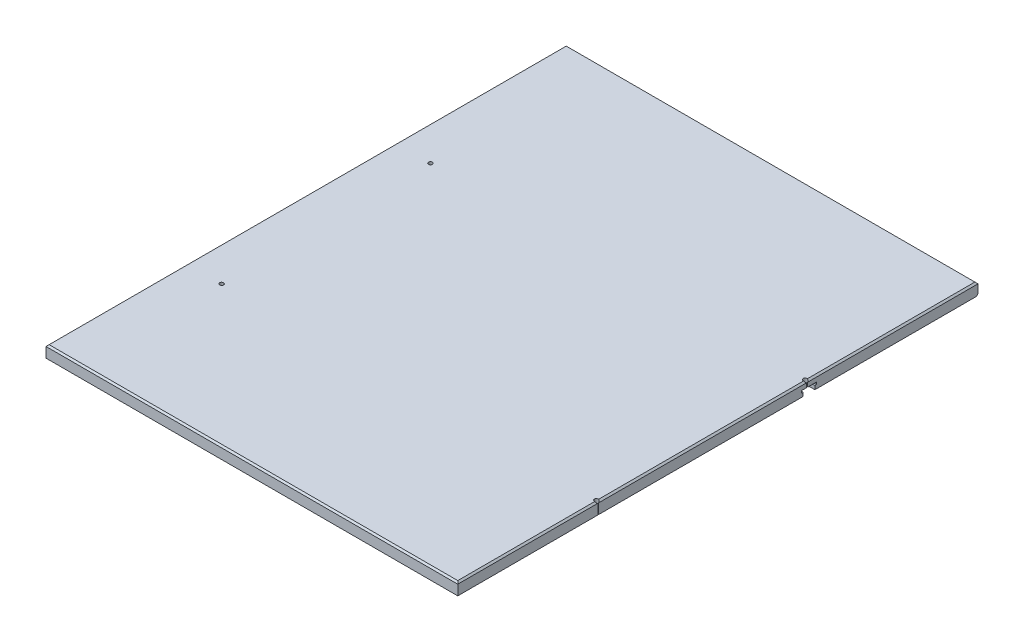
ISO-10303-21;
HEADER;
FILE_DESCRIPTION(('STEP AP214'),'2;1');
FILE_NAME('part.step','',(''),(''),'','','');
FILE_SCHEMA(('AUTOMOTIVE_DESIGN { 1 0 10303 214 1 1 1 1 }'));
ENDSEC;
DATA;
#1=APPLICATION_CONTEXT('core data for automotive mechanical design processes');
#2=APPLICATION_PROTOCOL_DEFINITION('international standard','automotive_design',2000,#1);
#3=PRODUCT_CONTEXT('',#1,'mechanical');
#4=PRODUCT('Part','Part','',(#3));
#5=PRODUCT_RELATED_PRODUCT_CATEGORY('part','',(#4));
#6=PRODUCT_DEFINITION_FORMATION('','',#4);
#7=PRODUCT_DEFINITION_CONTEXT('part definition',#1,'design');
#8=PRODUCT_DEFINITION('design','',#6,#7);
#9=PRODUCT_DEFINITION_SHAPE('','',#8);
#10=(LENGTH_UNIT() NAMED_UNIT(*) SI_UNIT(.MILLI.,.METRE.));
#11=(NAMED_UNIT(*) PLANE_ANGLE_UNIT() SI_UNIT($,.RADIAN.));
#12=(NAMED_UNIT(*) SI_UNIT($,.STERADIAN.) SOLID_ANGLE_UNIT());
#13=UNCERTAINTY_MEASURE_WITH_UNIT(LENGTH_MEASURE(1.E-05),#10,'distance_accuracy_value','');
#14=(GEOMETRIC_REPRESENTATION_CONTEXT(3) GLOBAL_UNCERTAINTY_ASSIGNED_CONTEXT((#13)) GLOBAL_UNIT_ASSIGNED_CONTEXT((#10,
#11,#12)) REPRESENTATION_CONTEXT('',''));
#15=CARTESIAN_POINT('',(0.,0.,0.));
#16=DIRECTION('',(0.,0.,1.));
#17=DIRECTION('',(1.,0.,0.));
#18=AXIS2_PLACEMENT_3D('',#15,#16,#17);
#19=CARTESIAN_POINT('',(669.8488,19.05,0.));
#20=DIRECTION('',(-1.,0.,0.));
#21=DIRECTION('',(0.,0.,1.));
#22=AXIS2_PLACEMENT_3D('',#19,#20,#21);
#23=PLANE('',#22);
#24=DIRECTION('',(0.,0.,1.));
#25=VECTOR('',#24,1.);
#26=CARTESIAN_POINT('',(669.8488,9.53134999998069,0.));
#27=LINE('',#26,#25);
#28=CARTESIAN_POINT('',(669.8488,9.53134999998069,-567.633578594489));
#29=VERTEX_POINT('',#28);
#30=CARTESIAN_POINT('',(669.8488,9.53134999998069,-559.216560000048));
#31=VERTEX_POINT('',#30);
#32=EDGE_CURVE('E353',#29,#31,#27,.T.);
#33=ORIENTED_EDGE('',*,*,#32,.F.);
#34=DIRECTION('',(0.,1.,0.));
#35=VECTOR('',#34,1.);
#36=CARTESIAN_POINT('',(669.8488,0.,-567.633578594489));
#37=LINE('',#36,#35);
#38=CARTESIAN_POINT('',(669.8488,16.5100000000001,-567.633578594489));
#39=VERTEX_POINT('',#38);
#40=EDGE_CURVE('E66',#29,#39,#37,.T.);
#41=ORIENTED_EDGE('',*,*,#40,.T.);
#42=DIRECTION('',(0.,0.,1.));
#43=VECTOR('',#42,1.);
#44=CARTESIAN_POINT('',(669.8488,16.5100000000001,0.));
#45=LINE('',#44,#43);
#46=CARTESIAN_POINT('',(669.8488,16.5100000000001,-229.291421405512));
#47=VERTEX_POINT('',#46);
#48=EDGE_CURVE('E201',#39,#47,#45,.T.);
#49=ORIENTED_EDGE('',*,*,#48,.T.);
#50=DIRECTION('',(0.,1.,0.));
#51=VECTOR('',#50,1.);
#52=CARTESIAN_POINT('',(669.8488,0.,-229.291421405512));
#53=LINE('',#52,#51);
#54=CARTESIAN_POINT('',(669.8488,0.,-229.291421405512));
#55=VERTEX_POINT('',#54);
#56=EDGE_CURVE('E58',#47,#55,#53,.F.);
#57=ORIENTED_EDGE('',*,*,#56,.T.);
#58=DIRECTION('',(0.,0.,-1.));
#59=VECTOR('',#58,1.);
#60=CARTESIAN_POINT('',(669.8488,0.,0.));
#61=LINE('',#60,#59);
#62=CARTESIAN_POINT('',(669.8488,0.,-561.883560000048));
#63=VERTEX_POINT('',#62);
#64=EDGE_CURVE('E300',#55,#63,#61,.T.);
#65=ORIENTED_EDGE('',*,*,#64,.T.);
#66=DIRECTION('',(0.,-1.,0.));
#67=VECTOR('',#66,1.);
#68=CARTESIAN_POINT('',(669.8488,0.,-561.883560000048));
#69=LINE('',#68,#67);
#70=CARTESIAN_POINT('',(669.8488,5.97534999998069,-561.883560000048));
#71=VERTEX_POINT('',#70);
#72=EDGE_CURVE('E326',#71,#63,#69,.T.);
#73=ORIENTED_EDGE('',*,*,#72,.F.);
#74=DIRECTION('',(0.,0.,-1.));
#75=VECTOR('',#74,1.);
#76=CARTESIAN_POINT('',(669.8488,5.97534999998069,0.));
#77=LINE('',#76,#75);
#78=CARTESIAN_POINT('',(669.8488,5.97534999998069,-559.216560000048));
#79=VERTEX_POINT('',#78);
#80=EDGE_CURVE('E356',#79,#71,#77,.T.);
#81=ORIENTED_EDGE('',*,*,#80,.F.);
#82=DIRECTION('',(0.,-1.,0.));
#83=VECTOR('',#82,1.);
#84=CARTESIAN_POINT('',(669.8488,0.,-559.216560000048));
#85=LINE('',#84,#83);
#86=EDGE_CURVE('E354',#31,#79,#85,.T.);
#87=ORIENTED_EDGE('',*,*,#86,.F.);
#88=EDGE_LOOP('',(#33,#41,#49,#57,#65,#73,#81,#87));
#89=FACE_BOUND('',#88,.T.);
#90=ADVANCED_FACE('F42',(#89),#23,.F.);
#91=CARTESIAN_POINT('',(669.8488,0.,0.));
#92=VERTEX_POINT('',#91);
#93=CARTESIAN_POINT('',(669.8488,0.,-227.908578594488));
#94=VERTEX_POINT('',#93);
#95=EDGE_CURVE('E298',#92,#94,#61,.T.);
#96=ORIENTED_EDGE('',*,*,#95,.T.);
#97=DIRECTION('',(0.,1.,0.));
#98=VECTOR('',#97,1.);
#99=CARTESIAN_POINT('',(669.8488,0.,-227.908578594488));
#100=LINE('',#99,#98);
#101=CARTESIAN_POINT('',(669.8488,16.5100000000001,-227.908578594488));
#102=VERTEX_POINT('',#101);
#103=EDGE_CURVE('E268',#94,#102,#100,.T.);
#104=ORIENTED_EDGE('',*,*,#103,.T.);
#105=CARTESIAN_POINT('',(669.8488,16.5100000000001,0.));
#106=VERTEX_POINT('',#105);
#107=EDGE_CURVE('E219',#102,#106,#45,.T.);
#108=ORIENTED_EDGE('',*,*,#107,.T.);
#109=DIRECTION('',(0.,-1.,0.));
#110=VECTOR('',#109,1.);
#111=CARTESIAN_POINT('',(669.8488,19.05,0.));
#112=LINE('',#111,#110);
#113=EDGE_CURVE('E266',#106,#92,#112,.T.);
#114=ORIENTED_EDGE('',*,*,#113,.T.);
#115=EDGE_LOOP('',(#96,#104,#108,#114));
#116=FACE_BOUND('',#115,.T.);
#117=ADVANCED_FACE('F265',(#116),#23,.F.);
#118=CARTESIAN_POINT('',(667.3088,19.05,0.));
#119=DIRECTION('',(-0.707106781186532,-0.707106781186563,0.));
#120=DIRECTION('',(0.,0.,-1.));
#121=AXIS2_PLACEMENT_3D('',#118,#119,#120);
#122=PLANE('',#121);
#123=CARTESIAN_POINT('',(666.75,19.6088000000002,-568.325));
#124=DIRECTION('',(-0.707106781186532,-0.707106781186563,0.));
#125=DIRECTION('',(-0.707106781186563,0.707106781186532,0.));
#126=AXIS2_PLACEMENT_3D('',#123,#124,#125);
#127=ELLIPSE('',#126,4.49012806053459,3.17500000000008);
#128=CARTESIAN_POINT('',(667.3088,19.05,-565.199561221204));
#129=VERTEX_POINT('',#128);
#130=EDGE_CURVE('E186',#129,#39,#127,.F.);
#131=ORIENTED_EDGE('',*,*,#130,.F.);
#132=DIRECTION('',(0.,0.,-1.));
#133=VECTOR('',#132,1.);
#134=CARTESIAN_POINT('',(667.3088,19.05,0.));
#135=LINE('',#134,#133);
#136=CARTESIAN_POINT('',(667.3088,19.05,-231.725438778796));
#137=VERTEX_POINT('',#136);
#138=EDGE_CURVE('E199',#137,#129,#135,.T.);
#139=ORIENTED_EDGE('',*,*,#138,.F.);
#140=CARTESIAN_POINT('',(666.75,19.6088000000001,-228.6));
#141=DIRECTION('',(-0.707106781186532,-0.707106781186563,0.));
#142=DIRECTION('',(-0.707106781186563,0.707106781186532,0.));
#143=AXIS2_PLACEMENT_3D('',#140,#141,#142);
#144=ELLIPSE('',#143,4.4901280605346,3.17500000000009);
#145=EDGE_CURVE('E47',#47,#137,#144,.F.);
#146=ORIENTED_EDGE('',*,*,#145,.F.);
#147=ORIENTED_EDGE('',*,*,#48,.F.);
#148=EDGE_LOOP('',(#131,#139,#146,#147));
#149=FACE_BOUND('',#148,.T.);
#150=ADVANCED_FACE('F198',(#149),#122,.F.);
#151=CARTESIAN_POINT('',(667.3088,19.05,-225.474561221204));
#152=VERTEX_POINT('',#151);
#153=EDGE_CURVE('E11',#152,#102,#144,.F.);
#154=ORIENTED_EDGE('',*,*,#153,.F.);
#155=CARTESIAN_POINT('',(667.3088,19.05,-2.53999999999999));
#156=VERTEX_POINT('',#155);
#157=EDGE_CURVE('E206',#156,#152,#135,.T.);
#158=ORIENTED_EDGE('',*,*,#157,.F.);
#159=DIRECTION('',(-0.577350269189634,0.577350269189609,-0.577350269189634));
#160=VECTOR('',#159,1.);
#161=CARTESIAN_POINT('',(444.872533333327,241.486266666664,-224.976266666673));
#162=LINE('',#161,#160);
#163=EDGE_CURVE('E236',#156,#106,#162,.F.);
#164=ORIENTED_EDGE('',*,*,#163,.T.);
#165=ORIENTED_EDGE('',*,*,#107,.F.);
#166=EDGE_LOOP('',(#154,#158,#164,#165));
#167=FACE_BOUND('',#166,.T.);
#168=ADVANCED_FACE('F288',(#167),#122,.F.);
#169=CARTESIAN_POINT('',(0.,19.05,0.));
#170=DIRECTION('',(1.,0.,0.));
#171=DIRECTION('',(0.,0.,-1.));
#172=AXIS2_PLACEMENT_3D('',#169,#170,#171);
#173=PLANE('',#172);
#174=DIRECTION('',(0.,1.,0.));
#175=VECTOR('',#174,1.);
#176=CARTESIAN_POINT('',(0.,0.,-580.933560000048));
#177=LINE('',#176,#175);
#178=CARTESIAN_POINT('',(0.,0.,-580.933560000048));
#179=VERTEX_POINT('',#178);
#180=CARTESIAN_POINT('',(0.,5.9753499999807,-580.933560000048));
#181=VERTEX_POINT('',#180);
#182=EDGE_CURVE('E323',#179,#181,#177,.T.);
#183=ORIENTED_EDGE('',*,*,#182,.T.);
#184=DIRECTION('',(0.,0.,-1.));
#185=VECTOR('',#184,1.);
#186=CARTESIAN_POINT('',(0.,5.9753499999807,0.));
#187=LINE('',#186,#185);
#188=CARTESIAN_POINT('',(0.,5.9753499999807,-583.600560000048));
#189=VERTEX_POINT('',#188);
#190=EDGE_CURVE('E327',#181,#189,#187,.T.);
#191=ORIENTED_EDGE('',*,*,#190,.T.);
#192=DIRECTION('',(0.,1.,0.));
#193=VECTOR('',#192,1.);
#194=CARTESIAN_POINT('',(0.,0.,-583.600560000048));
#195=LINE('',#194,#193);
#196=CARTESIAN_POINT('',(0.,9.53134999998069,-583.600560000048));
#197=VERTEX_POINT('',#196);
#198=EDGE_CURVE('E330',#189,#197,#195,.T.);
#199=ORIENTED_EDGE('',*,*,#198,.T.);
#200=DIRECTION('',(0.,0.,1.));
#201=VECTOR('',#200,1.);
#202=CARTESIAN_POINT('',(0.,9.53134999998069,0.));
#203=LINE('',#202,#201);
#204=CARTESIAN_POINT('',(0.,9.53134999998069,-559.216560000048));
#205=VERTEX_POINT('',#204);
#206=EDGE_CURVE('E333',#197,#205,#203,.T.);
#207=ORIENTED_EDGE('',*,*,#206,.T.);
#208=DIRECTION('',(0.,-1.,0.));
#209=VECTOR('',#208,1.);
#210=CARTESIAN_POINT('',(0.,0.,-559.216560000048));
#211=LINE('',#210,#209);
#212=CARTESIAN_POINT('',(0.,5.97534999998069,-559.216560000048));
#213=VERTEX_POINT('',#212);
#214=EDGE_CURVE('E336',#205,#213,#211,.T.);
#215=ORIENTED_EDGE('',*,*,#214,.T.);
#216=DIRECTION('',(0.,0.,-1.));
#217=VECTOR('',#216,1.);
#218=CARTESIAN_POINT('',(0.,5.97534999998069,0.));
#219=LINE('',#218,#217);
#220=CARTESIAN_POINT('',(0.,5.97534999998069,-561.883560000048));
#221=VERTEX_POINT('',#220);
#222=EDGE_CURVE('E339',#213,#221,#219,.T.);
#223=ORIENTED_EDGE('',*,*,#222,.T.);
#224=DIRECTION('',(0.,-1.,0.));
#225=VECTOR('',#224,1.);
#226=CARTESIAN_POINT('',(0.,0.,-561.883560000048));
#227=LINE('',#226,#225);
#228=CARTESIAN_POINT('',(0.,0.,-561.883560000048));
#229=VERTEX_POINT('',#228);
#230=EDGE_CURVE('E342',#221,#229,#227,.T.);
#231=ORIENTED_EDGE('',*,*,#230,.T.);
#232=DIRECTION('',(0.,0.,1.));
#233=VECTOR('',#232,1.);
#234=CARTESIAN_POINT('',(0.,0.,0.));
#235=LINE('',#234,#233);
#236=CARTESIAN_POINT('',(0.,0.,0.));
#237=VERTEX_POINT('',#236);
#238=EDGE_CURVE('E239',#229,#237,#235,.T.);
#239=ORIENTED_EDGE('',*,*,#238,.T.);
#240=DIRECTION('',(0.,-1.,0.));
#241=VECTOR('',#240,1.);
#242=CARTESIAN_POINT('',(0.,19.05,0.));
#243=LINE('',#242,#241);
#244=CARTESIAN_POINT('',(0.,16.5100000000001,0.));
#245=VERTEX_POINT('',#244);
#246=EDGE_CURVE('E278',#245,#237,#243,.T.);
#247=ORIENTED_EDGE('',*,*,#246,.F.);
#248=DIRECTION('',(0.,0.,-1.));
#249=VECTOR('',#248,1.);
#250=CARTESIAN_POINT('',(0.,16.5100000000001,0.));
#251=LINE('',#250,#249);
#252=CARTESIAN_POINT('',(0.,16.5100000000001,-846.328));
#253=VERTEX_POINT('',#252);
#254=EDGE_CURVE('E225',#245,#253,#251,.T.);
#255=ORIENTED_EDGE('',*,*,#254,.T.);
#256=DIRECTION('',(0.,-1.,0.));
#257=VECTOR('',#256,1.);
#258=CARTESIAN_POINT('',(0.,19.05,-846.328));
#259=LINE('',#258,#257);
#260=CARTESIAN_POINT('',(0.,2.5400000000001,-846.328));
#261=VERTEX_POINT('',#260);
#262=EDGE_CURVE('E295',#253,#261,#259,.T.);
#263=ORIENTED_EDGE('',*,*,#262,.T.);
#264=DIRECTION('',(0.,-0.707106781186548,0.707106781186548));
#265=VECTOR('',#264,1.);
#266=CARTESIAN_POINT('',(0.,2.5400000000001,-846.328));
#267=LINE('',#266,#265);
#268=CARTESIAN_POINT('',(0.,0.,-843.788));
#269=VERTEX_POINT('',#268);
#270=EDGE_CURVE('E242',#261,#269,#267,.T.);
#271=ORIENTED_EDGE('',*,*,#270,.T.);
#272=EDGE_CURVE('E303',#269,#179,#235,.T.);
#273=ORIENTED_EDGE('',*,*,#272,.T.);
#274=EDGE_LOOP('',(#183,#191,#199,#207,#215,#223,#231,#239,#247,#255,#263,#271,#273));
#275=FACE_BOUND('',#274,.T.);
#276=ADVANCED_FACE('F397',(#275),#173,.F.);
#277=CARTESIAN_POINT('',(669.8488,16.5100000000001,-846.328));
#278=VERTEX_POINT('',#277);
#279=CARTESIAN_POINT('',(669.8488,16.5100000000001,-569.016421405511));
#280=VERTEX_POINT('',#279);
#281=EDGE_CURVE('E220',#278,#280,#45,.T.);
#282=ORIENTED_EDGE('',*,*,#281,.T.);
#283=DIRECTION('',(0.,1.,0.));
#284=VECTOR('',#283,1.);
#285=CARTESIAN_POINT('',(669.8488,0.,-569.016421405511));
#286=LINE('',#285,#284);
#287=CARTESIAN_POINT('',(669.8488,9.53134999998069,-569.016421405511));
#288=VERTEX_POINT('',#287);
#289=EDGE_CURVE('E252',#280,#288,#286,.F.);
#290=ORIENTED_EDGE('',*,*,#289,.T.);
#291=CARTESIAN_POINT('',(669.8488,9.53134999998069,-583.600560000048));
#292=VERTEX_POINT('',#291);
#293=EDGE_CURVE('E350',#292,#288,#27,.T.);
#294=ORIENTED_EDGE('',*,*,#293,.F.);
#295=DIRECTION('',(0.,1.,0.));
#296=VECTOR('',#295,1.);
#297=CARTESIAN_POINT('',(669.8488,0.,-583.600560000048));
#298=LINE('',#297,#296);
#299=CARTESIAN_POINT('',(669.8488,5.9753499999807,-583.600560000048));
#300=VERTEX_POINT('',#299);
#301=EDGE_CURVE('E348',#300,#292,#298,.T.);
#302=ORIENTED_EDGE('',*,*,#301,.F.);
#303=DIRECTION('',(0.,0.,-1.));
#304=VECTOR('',#303,1.);
#305=CARTESIAN_POINT('',(669.8488,5.9753499999807,0.));
#306=LINE('',#305,#304);
#307=CARTESIAN_POINT('',(669.8488,5.9753499999807,-580.933560000048));
#308=VERTEX_POINT('',#307);
#309=EDGE_CURVE('E346',#308,#300,#306,.T.);
#310=ORIENTED_EDGE('',*,*,#309,.F.);
#311=DIRECTION('',(0.,1.,0.));
#312=VECTOR('',#311,1.);
#313=CARTESIAN_POINT('',(669.8488,0.,-580.933560000048));
#314=LINE('',#313,#312);
#315=CARTESIAN_POINT('',(669.8488,0.,-580.933560000048));
#316=VERTEX_POINT('',#315);
#317=EDGE_CURVE('E309',#316,#308,#314,.T.);
#318=ORIENTED_EDGE('',*,*,#317,.F.);
#319=CARTESIAN_POINT('',(669.8488,0.,-843.788));
#320=VERTEX_POINT('',#319);
#321=EDGE_CURVE('E301',#316,#320,#61,.T.);
#322=ORIENTED_EDGE('',*,*,#321,.T.);
#323=DIRECTION('',(0.,0.707106781186548,-0.707106781186548));
#324=VECTOR('',#323,1.);
#325=CARTESIAN_POINT('',(669.8488,2.5400000000001,-846.328));
#326=LINE('',#325,#324);
#327=CARTESIAN_POINT('',(669.8488,2.5400000000001,-846.328));
#328=VERTEX_POINT('',#327);
#329=EDGE_CURVE('E247',#320,#328,#326,.T.);
#330=ORIENTED_EDGE('',*,*,#329,.T.);
#331=DIRECTION('',(0.,-1.,0.));
#332=VECTOR('',#331,1.);
#333=CARTESIAN_POINT('',(669.8488,19.05,-846.328));
#334=LINE('',#333,#332);
#335=EDGE_CURVE('E279',#278,#328,#334,.T.);
#336=ORIENTED_EDGE('',*,*,#335,.F.);
#337=EDGE_LOOP('',(#282,#290,#294,#302,#310,#318,#322,#330,#336));
#338=FACE_BOUND('',#337,.T.);
#339=ADVANCED_FACE('F382',(#338),#23,.F.);
#340=CARTESIAN_POINT('',(0.,0.,0.));
#341=DIRECTION('',(0.,-1.,0.));
#342=DIRECTION('',(0.,0.,-1.));
#343=AXIS2_PLACEMENT_3D('',#340,#341,#342);
#344=PLANE('',#343);
#345=ORIENTED_EDGE('',*,*,#321,.F.);
#346=DIRECTION('',(-1.,0.,0.));
#347=VECTOR('',#346,1.);
#348=CARTESIAN_POINT('',(669.8488,0.,-580.933560000048));
#349=LINE('',#348,#347);
#350=EDGE_CURVE('E231',#316,#179,#349,.T.);
#351=ORIENTED_EDGE('',*,*,#350,.T.);
#352=ORIENTED_EDGE('',*,*,#272,.F.);
#353=DIRECTION('',(1.,0.,0.));
#354=VECTOR('',#353,1.);
#355=CARTESIAN_POINT('',(669.8488,0.,-843.788));
#356=LINE('',#355,#354);
#357=EDGE_CURVE('E244',#269,#320,#356,.T.);
#358=ORIENTED_EDGE('',*,*,#357,.T.);
#359=EDGE_LOOP('',(#345,#351,#352,#358));
#360=FACE_BOUND('',#359,.T.);
#361=ADVANCED_FACE('F389',(#360),#344,.T.);
#362=CARTESIAN_POINT('',(57.15,0.,-228.6));
#363=DIRECTION('',(0.,1.,0.));
#364=DIRECTION('',(0.,0.,1.));
#365=AXIS2_PLACEMENT_3D('',#362,#363,#364);
#366=CIRCLE('',#365,3.175);
#367=CARTESIAN_POINT('',(57.15,0.,-225.425));
#368=VERTEX_POINT('',#367);
#369=EDGE_CURVE('E192',#368,#368,#366,.T.);
#370=ORIENTED_EDGE('',*,*,#369,.T.);
#371=EDGE_LOOP('',(#370));
#372=FACE_BOUND('',#371,.T.);
#373=CARTESIAN_POINT('',(666.75,0.,-228.6));
#374=DIRECTION('',(0.,1.,0.));
#375=DIRECTION('',(0.,0.,1.));
#376=AXIS2_PLACEMENT_3D('',#373,#374,#375);
#377=CIRCLE('',#376,3.17500000000009);
#378=EDGE_CURVE('E371',#55,#94,#377,.T.);
#379=ORIENTED_EDGE('',*,*,#378,.T.);
#380=ORIENTED_EDGE('',*,*,#95,.F.);
#381=DIRECTION('',(1.,0.,0.));
#382=VECTOR('',#381,1.);
#383=CARTESIAN_POINT('',(0.,0.,0.));
#384=LINE('',#383,#382);
#385=EDGE_CURVE('E276',#237,#92,#384,.T.);
#386=ORIENTED_EDGE('',*,*,#385,.F.);
#387=ORIENTED_EDGE('',*,*,#238,.F.);
#388=DIRECTION('',(-1.,0.,0.));
#389=VECTOR('',#388,1.);
#390=CARTESIAN_POINT('',(669.8488,0.,-561.883560000048));
#391=LINE('',#390,#389);
#392=EDGE_CURVE('E306',#63,#229,#391,.T.);
#393=ORIENTED_EDGE('',*,*,#392,.F.);
#394=ORIENTED_EDGE('',*,*,#64,.F.);
#395=EDGE_LOOP('',(#379,#380,#386,#387,#393,#394));
#396=FACE_BOUND('',#395,.T.);
#397=ADVANCED_FACE('F375',(#372,#396),#344,.T.);
#398=CARTESIAN_POINT('',(0.,19.05,0.));
#399=DIRECTION('',(0.,0.,-1.));
#400=DIRECTION('',(-1.,0.,0.));
#401=AXIS2_PLACEMENT_3D('',#398,#399,#400);
#402=PLANE('',#401);
#403=ORIENTED_EDGE('',*,*,#113,.F.);
#404=DIRECTION('',(-1.,0.,0.));
#405=VECTOR('',#404,1.);
#406=CARTESIAN_POINT('',(0.,16.5100000000001,0.));
#407=LINE('',#406,#405);
#408=EDGE_CURVE('E223',#106,#245,#407,.T.);
#409=ORIENTED_EDGE('',*,*,#408,.T.);
#410=ORIENTED_EDGE('',*,*,#246,.T.);
#411=ORIENTED_EDGE('',*,*,#385,.T.);
#412=EDGE_LOOP('',(#403,#409,#410,#411));
#413=FACE_BOUND('',#412,.T.);
#414=ADVANCED_FACE('F272',(#413),#402,.F.);
#415=CARTESIAN_POINT('',(0.,19.05,-846.328));
#416=DIRECTION('',(0.,0.,1.));
#417=DIRECTION('',(1.,0.,0.));
#418=AXIS2_PLACEMENT_3D('',#415,#416,#417);
#419=PLANE('',#418);
#420=ORIENTED_EDGE('',*,*,#335,.T.);
#421=DIRECTION('',(-1.,0.,0.));
#422=VECTOR('',#421,1.);
#423=CARTESIAN_POINT('',(0.,2.5400000000001,-846.328));
#424=LINE('',#423,#422);
#425=EDGE_CURVE('E227',#328,#261,#424,.T.);
#426=ORIENTED_EDGE('',*,*,#425,.T.);
#427=ORIENTED_EDGE('',*,*,#262,.F.);
#428=DIRECTION('',(1.,0.,0.));
#429=VECTOR('',#428,1.);
#430=CARTESIAN_POINT('',(0.,16.5100000000001,-846.328));
#431=LINE('',#430,#429);
#432=EDGE_CURVE('E216',#253,#278,#431,.T.);
#433=ORIENTED_EDGE('',*,*,#432,.T.);
#434=EDGE_LOOP('',(#420,#426,#427,#433));
#435=FACE_BOUND('',#434,.T.);
#436=ADVANCED_FACE('F394',(#435),#419,.F.);
#437=CARTESIAN_POINT('',(0.,19.05,0.));
#438=DIRECTION('',(0.,-1.,0.));
#439=DIRECTION('',(0.,0.,-1.));
#440=AXIS2_PLACEMENT_3D('',#437,#438,#439);
#441=PLANE('',#440);
#442=CARTESIAN_POINT('',(57.15,19.05,-228.6));
#443=DIRECTION('',(0.,1.,0.));
#444=DIRECTION('',(0.,0.,1.));
#445=AXIS2_PLACEMENT_3D('',#442,#443,#444);
#446=CIRCLE('',#445,3.175);
#447=CARTESIAN_POINT('',(57.15,19.05,-225.425));
#448=VERTEX_POINT('',#447);
#449=EDGE_CURVE('E365',#448,#448,#446,.T.);
#450=ORIENTED_EDGE('',*,*,#449,.F.);
#451=EDGE_LOOP('',(#450));
#452=FACE_BOUND('',#451,.T.);
#453=CARTESIAN_POINT('',(57.1499999999999,19.05,-568.325));
#454=DIRECTION('',(0.,1.,0.));
#455=DIRECTION('',(0.,0.,1.));
#456=AXIS2_PLACEMENT_3D('',#453,#454,#455);
#457=CIRCLE('',#456,3.175);
#458=CARTESIAN_POINT('',(57.1499999999999,19.05,-565.15));
#459=VERTEX_POINT('',#458);
#460=EDGE_CURVE('E253',#459,#459,#457,.T.);
#461=ORIENTED_EDGE('',*,*,#460,.F.);
#462=EDGE_LOOP('',(#461));
#463=FACE_BOUND('',#462,.T.);
#464=ORIENTED_EDGE('',*,*,#138,.T.);
#465=CARTESIAN_POINT('',(666.75,19.05,-568.325));
#466=DIRECTION('',(0.,1.,0.));
#467=DIRECTION('',(0.,0.,1.));
#468=AXIS2_PLACEMENT_3D('',#465,#466,#467);
#469=CIRCLE('',#468,3.17500000000008);
#470=CARTESIAN_POINT('',(667.3088,19.05,-571.450438778796));
#471=VERTEX_POINT('',#470);
#472=EDGE_CURVE('E183',#471,#129,#469,.T.);
#473=ORIENTED_EDGE('',*,*,#472,.F.);
#474=CARTESIAN_POINT('',(667.3088,19.05,-843.788));
#475=VERTEX_POINT('',#474);
#476=EDGE_CURVE('E207',#471,#475,#135,.T.);
#477=ORIENTED_EDGE('',*,*,#476,.T.);
#478=DIRECTION('',(-1.,0.,0.));
#479=VECTOR('',#478,1.);
#480=CARTESIAN_POINT('',(0.,19.05,-843.788));
#481=LINE('',#480,#479);
#482=CARTESIAN_POINT('',(2.53999999999999,19.05,-843.788));
#483=VERTEX_POINT('',#482);
#484=EDGE_CURVE('E209',#475,#483,#481,.T.);
#485=ORIENTED_EDGE('',*,*,#484,.T.);
#486=DIRECTION('',(0.,0.,1.));
#487=VECTOR('',#486,1.);
#488=CARTESIAN_POINT('',(2.53999999999999,19.05,0.));
#489=LINE('',#488,#487);
#490=CARTESIAN_POINT('',(2.53999999999999,19.05,-2.53999999999999));
#491=VERTEX_POINT('',#490);
#492=EDGE_CURVE('E290',#483,#491,#489,.T.);
#493=ORIENTED_EDGE('',*,*,#492,.T.);
#494=DIRECTION('',(1.,0.,0.));
#495=VECTOR('',#494,1.);
#496=CARTESIAN_POINT('',(0.,19.05,-2.53999999999999));
#497=LINE('',#496,#495);
#498=EDGE_CURVE('E210',#491,#156,#497,.T.);
#499=ORIENTED_EDGE('',*,*,#498,.T.);
#500=ORIENTED_EDGE('',*,*,#157,.T.);
#501=CARTESIAN_POINT('',(666.75,19.05,-228.6));
#502=DIRECTION('',(0.,1.,0.));
#503=DIRECTION('',(0.,0.,1.));
#504=AXIS2_PLACEMENT_3D('',#501,#502,#503);
#505=CIRCLE('',#504,3.17500000000009);
#506=EDGE_CURVE('E193',#137,#152,#505,.T.);
#507=ORIENTED_EDGE('',*,*,#506,.F.);
#508=EDGE_LOOP('',(#464,#473,#477,#485,#493,#499,#500,#507));
#509=FACE_BOUND('',#508,.T.);
#510=ADVANCED_FACE('F204',(#452,#463,#509),#441,.F.);
#511=CARTESIAN_POINT('',(0.,19.05,-2.53999999999999));
#512=DIRECTION('',(0.,-0.707106781186563,-0.707106781186532));
#513=DIRECTION('',(1.,0.,0.));
#514=AXIS2_PLACEMENT_3D('',#511,#512,#513);
#515=PLANE('',#514);
#516=DIRECTION('',(0.577350269189634,0.577350269189609,-0.577350269189634));
#517=VECTOR('',#516,1.);
#518=CARTESIAN_POINT('',(1.6933333333333,18.2033333333334,-1.6933333333333));
#519=LINE('',#518,#517);
#520=EDGE_CURVE('E233',#245,#491,#519,.T.);
#521=ORIENTED_EDGE('',*,*,#520,.F.);
#522=ORIENTED_EDGE('',*,*,#408,.F.);
#523=ORIENTED_EDGE('',*,*,#163,.F.);
#524=ORIENTED_EDGE('',*,*,#498,.F.);
#525=EDGE_LOOP('',(#521,#522,#523,#524));
#526=FACE_BOUND('',#525,.T.);
#527=ADVANCED_FACE('F284',(#526),#515,.F.);
#528=EDGE_CURVE('E188',#280,#471,#127,.F.);
#529=ORIENTED_EDGE('',*,*,#528,.F.);
#530=ORIENTED_EDGE('',*,*,#281,.F.);
#531=DIRECTION('',(-0.577350269189634,0.577350269189609,0.577350269189634));
#532=VECTOR('',#531,1.);
#533=CARTESIAN_POINT('',(386.046133333325,300.312666666663,-562.525333333325));
#534=LINE('',#533,#532);
#535=EDGE_CURVE('E230',#475,#278,#534,.F.);
#536=ORIENTED_EDGE('',*,*,#535,.F.);
#537=ORIENTED_EDGE('',*,*,#476,.F.);
#538=EDGE_LOOP('',(#529,#530,#536,#537));
#539=FACE_BOUND('',#538,.T.);
#540=ADVANCED_FACE('F408',(#539),#122,.F.);
#541=CARTESIAN_POINT('',(2.53999999999999,19.05,0.));
#542=DIRECTION('',(0.707106781186532,-0.707106781186563,0.));
#543=DIRECTION('',(0.,0.,1.));
#544=AXIS2_PLACEMENT_3D('',#541,#542,#543);
#545=PLANE('',#544);
#546=ORIENTED_EDGE('',*,*,#520,.T.);
#547=ORIENTED_EDGE('',*,*,#492,.F.);
#548=DIRECTION('',(-0.577350269189634,-0.577350269189609,-0.577350269189634));
#549=VECTOR('',#548,1.);
#550=CARTESIAN_POINT('',(283.802666666675,300.312666666663,-562.525333333325));
#551=LINE('',#550,#549);
#552=EDGE_CURVE('E228',#253,#483,#551,.F.);
#553=ORIENTED_EDGE('',*,*,#552,.F.);
#554=ORIENTED_EDGE('',*,*,#254,.F.);
#555=EDGE_LOOP('',(#546,#547,#553,#554));
#556=FACE_BOUND('',#555,.T.);
#557=ADVANCED_FACE('F400',(#556),#545,.F.);
#558=CARTESIAN_POINT('',(0.,19.05,-843.788));
#559=DIRECTION('',(0.,-0.707106781186563,0.707106781186532));
#560=DIRECTION('',(-1.,0.,0.));
#561=AXIS2_PLACEMENT_3D('',#558,#559,#560);
#562=PLANE('',#561);
#563=ORIENTED_EDGE('',*,*,#535,.T.);
#564=ORIENTED_EDGE('',*,*,#432,.F.);
#565=ORIENTED_EDGE('',*,*,#552,.T.);
#566=ORIENTED_EDGE('',*,*,#484,.F.);
#567=EDGE_LOOP('',(#563,#564,#565,#566));
#568=FACE_BOUND('',#567,.T.);
#569=ADVANCED_FACE('F403',(#568),#562,.F.);
#570=CARTESIAN_POINT('',(0.,2.5400000000001,-846.328));
#571=DIRECTION('',(0.,-0.707106781186548,-0.707106781186548));
#572=DIRECTION('',(1.,0.,0.));
#573=AXIS2_PLACEMENT_3D('',#570,#571,#572);
#574=PLANE('',#573);
#575=ORIENTED_EDGE('',*,*,#329,.F.);
#576=ORIENTED_EDGE('',*,*,#357,.F.);
#577=ORIENTED_EDGE('',*,*,#270,.F.);
#578=ORIENTED_EDGE('',*,*,#425,.F.);
#579=EDGE_LOOP('',(#575,#576,#577,#578));
#580=FACE_BOUND('',#579,.T.);
#581=ADVANCED_FACE('F45',(#580),#574,.T.);
#582=CARTESIAN_POINT('',(669.8488,0.,-580.933560000048));
#583=DIRECTION('',(0.,0.,1.));
#584=DIRECTION('',(1.,0.,0.));
#585=AXIS2_PLACEMENT_3D('',#582,#583,#584);
#586=PLANE('',#585);
#587=ORIENTED_EDGE('',*,*,#182,.F.);
#588=ORIENTED_EDGE('',*,*,#350,.F.);
#589=ORIENTED_EDGE('',*,*,#317,.T.);
#590=DIRECTION('',(-1.,0.,0.));
#591=VECTOR('',#590,1.);
#592=CARTESIAN_POINT('',(669.8488,5.9753499999807,-580.933560000048));
#593=LINE('',#592,#591);
#594=EDGE_CURVE('E319',#308,#181,#593,.T.);
#595=ORIENTED_EDGE('',*,*,#594,.T.);
#596=EDGE_LOOP('',(#587,#588,#589,#595));
#597=FACE_BOUND('',#596,.T.);
#598=ADVANCED_FACE('F456',(#597),#586,.T.);
#599=CARTESIAN_POINT('',(669.8488,5.9753499999807,0.));
#600=DIRECTION('',(0.,1.,0.));
#601=DIRECTION('',(0.,0.,1.));
#602=AXIS2_PLACEMENT_3D('',#599,#600,#601);
#603=PLANE('',#602);
#604=ORIENTED_EDGE('',*,*,#190,.F.);
#605=ORIENTED_EDGE('',*,*,#594,.F.);
#606=ORIENTED_EDGE('',*,*,#309,.T.);
#607=DIRECTION('',(-1.,0.,0.));
#608=VECTOR('',#607,1.);
#609=CARTESIAN_POINT('',(669.8488,5.9753499999807,-583.600560000048));
#610=LINE('',#609,#608);
#611=EDGE_CURVE('E317',#300,#189,#610,.T.);
#612=ORIENTED_EDGE('',*,*,#611,.T.);
#613=EDGE_LOOP('',(#604,#605,#606,#612));
#614=FACE_BOUND('',#613,.T.);
#615=ADVANCED_FACE('F460',(#614),#603,.T.);
#616=CARTESIAN_POINT('',(669.8488,0.,-583.600560000048));
#617=DIRECTION('',(0.,0.,1.));
#618=DIRECTION('',(1.,0.,0.));
#619=AXIS2_PLACEMENT_3D('',#616,#617,#618);
#620=PLANE('',#619);
#621=ORIENTED_EDGE('',*,*,#198,.F.);
#622=ORIENTED_EDGE('',*,*,#611,.F.);
#623=ORIENTED_EDGE('',*,*,#301,.T.);
#624=DIRECTION('',(-1.,0.,0.));
#625=VECTOR('',#624,1.);
#626=CARTESIAN_POINT('',(669.8488,9.53134999998069,-583.600560000048));
#627=LINE('',#626,#625);
#628=EDGE_CURVE('E315',#292,#197,#627,.T.);
#629=ORIENTED_EDGE('',*,*,#628,.T.);
#630=EDGE_LOOP('',(#621,#622,#623,#629));
#631=FACE_BOUND('',#630,.T.);
#632=ADVANCED_FACE('F466',(#631),#620,.T.);
#633=CARTESIAN_POINT('',(669.8488,9.53134999998069,0.));
#634=DIRECTION('',(0.,-1.,0.));
#635=DIRECTION('',(0.,0.,-1.));
#636=AXIS2_PLACEMENT_3D('',#633,#634,#635);
#637=PLANE('',#636);
#638=CARTESIAN_POINT('',(666.75,9.53134999998069,-568.325));
#639=DIRECTION('',(0.,-1.,0.));
#640=DIRECTION('',(0.,0.,-1.));
#641=AXIS2_PLACEMENT_3D('',#638,#639,#640);
#642=CIRCLE('',#641,3.17500000000008);
#643=EDGE_CURVE('E249',#29,#288,#642,.T.);
#644=ORIENTED_EDGE('',*,*,#643,.F.);
#645=ORIENTED_EDGE('',*,*,#32,.T.);
#646=DIRECTION('',(-1.,0.,0.));
#647=VECTOR('',#646,1.);
#648=CARTESIAN_POINT('',(669.8488,9.53134999998069,-559.216560000048));
#649=LINE('',#648,#647);
#650=EDGE_CURVE('E313',#31,#205,#649,.T.);
#651=ORIENTED_EDGE('',*,*,#650,.T.);
#652=ORIENTED_EDGE('',*,*,#206,.F.);
#653=ORIENTED_EDGE('',*,*,#628,.F.);
#654=ORIENTED_EDGE('',*,*,#293,.T.);
#655=EDGE_LOOP('',(#644,#645,#651,#652,#653,#654));
#656=FACE_BOUND('',#655,.T.);
#657=CARTESIAN_POINT('',(57.1499999999999,9.53134999998069,-568.325));
#658=DIRECTION('',(0.,-1.,0.));
#659=DIRECTION('',(0.,0.,-1.));
#660=AXIS2_PLACEMENT_3D('',#657,#658,#659);
#661=CIRCLE('',#660,3.175);
#662=CARTESIAN_POINT('',(57.1499999999999,9.53134999998069,-571.5));
#663=VERTEX_POINT('',#662);
#664=EDGE_CURVE('E250',#663,#663,#661,.T.);
#665=ORIENTED_EDGE('',*,*,#664,.F.);
#666=EDGE_LOOP('',(#665));
#667=FACE_BOUND('',#666,.T.);
#668=ADVANCED_FACE('F475',(#656,#667),#637,.T.);
#669=CARTESIAN_POINT('',(669.8488,0.,-559.216560000048));
#670=DIRECTION('',(0.,0.,-1.));
#671=DIRECTION('',(-1.,0.,0.));
#672=AXIS2_PLACEMENT_3D('',#669,#670,#671);
#673=PLANE('',#672);
#674=ORIENTED_EDGE('',*,*,#214,.F.);
#675=ORIENTED_EDGE('',*,*,#650,.F.);
#676=ORIENTED_EDGE('',*,*,#86,.T.);
#677=DIRECTION('',(-1.,0.,0.));
#678=VECTOR('',#677,1.);
#679=CARTESIAN_POINT('',(669.8488,5.97534999998069,-559.216560000048));
#680=LINE('',#679,#678);
#681=EDGE_CURVE('E311',#79,#213,#680,.T.);
#682=ORIENTED_EDGE('',*,*,#681,.T.);
#683=EDGE_LOOP('',(#674,#675,#676,#682));
#684=FACE_BOUND('',#683,.T.);
#685=ADVANCED_FACE('F478',(#684),#673,.T.);
#686=CARTESIAN_POINT('',(669.8488,5.97534999998069,0.));
#687=DIRECTION('',(0.,1.,0.));
#688=DIRECTION('',(0.,0.,1.));
#689=AXIS2_PLACEMENT_3D('',#686,#687,#688);
#690=PLANE('',#689);
#691=ORIENTED_EDGE('',*,*,#222,.F.);
#692=ORIENTED_EDGE('',*,*,#681,.F.);
#693=ORIENTED_EDGE('',*,*,#80,.T.);
#694=DIRECTION('',(-1.,0.,0.));
#695=VECTOR('',#694,1.);
#696=CARTESIAN_POINT('',(669.8488,5.97534999998069,-561.883560000048));
#697=LINE('',#696,#695);
#698=EDGE_CURVE('E308',#71,#221,#697,.T.);
#699=ORIENTED_EDGE('',*,*,#698,.T.);
#700=EDGE_LOOP('',(#691,#692,#693,#699));
#701=FACE_BOUND('',#700,.T.);
#702=ADVANCED_FACE('F482',(#701),#690,.T.);
#703=CARTESIAN_POINT('',(669.8488,0.,-561.883560000048));
#704=DIRECTION('',(0.,0.,-1.));
#705=DIRECTION('',(-1.,0.,0.));
#706=AXIS2_PLACEMENT_3D('',#703,#704,#705);
#707=PLANE('',#706);
#708=ORIENTED_EDGE('',*,*,#230,.F.);
#709=ORIENTED_EDGE('',*,*,#698,.F.);
#710=ORIENTED_EDGE('',*,*,#72,.T.);
#711=ORIENTED_EDGE('',*,*,#392,.T.);
#712=EDGE_LOOP('',(#708,#709,#710,#711));
#713=FACE_BOUND('',#712,.T.);
#714=ADVANCED_FACE('F486',(#713),#707,.T.);
#715=CARTESIAN_POINT('',(57.1499999999999,0.,-568.325));
#716=DIRECTION('',(0.,1.,0.));
#717=DIRECTION('',(0.,0.,1.));
#718=AXIS2_PLACEMENT_3D('',#715,#716,#717);
#719=CYLINDRICAL_SURFACE('',#718,3.175);
#720=ORIENTED_EDGE('',*,*,#664,.T.);
#721=EDGE_LOOP('',(#720));
#722=FACE_BOUND('',#721,.T.);
#723=ORIENTED_EDGE('',*,*,#460,.T.);
#724=EDGE_LOOP('',(#723));
#725=FACE_BOUND('',#724,.T.);
#726=ADVANCED_FACE('F470',(#722,#725),#719,.F.);
#727=CARTESIAN_POINT('',(666.75,0.,-568.325));
#728=DIRECTION('',(0.,1.,0.));
#729=DIRECTION('',(0.,0.,1.));
#730=AXIS2_PLACEMENT_3D('',#727,#728,#729);
#731=CYLINDRICAL_SURFACE('',#730,3.17500000000008);
#732=ORIENTED_EDGE('',*,*,#130,.T.);
#733=ORIENTED_EDGE('',*,*,#40,.F.);
#734=ORIENTED_EDGE('',*,*,#643,.T.);
#735=ORIENTED_EDGE('',*,*,#289,.F.);
#736=ORIENTED_EDGE('',*,*,#528,.T.);
#737=ORIENTED_EDGE('',*,*,#472,.T.);
#738=EDGE_LOOP('',(#732,#733,#734,#735,#736,#737));
#739=FACE_BOUND('',#738,.T.);
#740=ADVANCED_FACE('F185',(#739),#731,.F.);
#741=CARTESIAN_POINT('',(666.75,0.,-228.6));
#742=DIRECTION('',(0.,1.,0.));
#743=DIRECTION('',(0.,0.,1.));
#744=AXIS2_PLACEMENT_3D('',#741,#742,#743);
#745=CYLINDRICAL_SURFACE('',#744,3.17500000000009);
#746=ORIENTED_EDGE('',*,*,#378,.F.);
#747=ORIENTED_EDGE('',*,*,#56,.F.);
#748=ORIENTED_EDGE('',*,*,#145,.T.);
#749=ORIENTED_EDGE('',*,*,#506,.T.);
#750=ORIENTED_EDGE('',*,*,#153,.T.);
#751=ORIENTED_EDGE('',*,*,#103,.F.);
#752=EDGE_LOOP('',(#746,#747,#748,#749,#750,#751));
#753=FACE_BOUND('',#752,.T.);
#754=ADVANCED_FACE('F255',(#753),#745,.F.);
#755=CARTESIAN_POINT('',(57.15,0.,-228.6));
#756=DIRECTION('',(0.,1.,0.));
#757=DIRECTION('',(0.,0.,1.));
#758=AXIS2_PLACEMENT_3D('',#755,#756,#757);
#759=CYLINDRICAL_SURFACE('',#758,3.175);
#760=ORIENTED_EDGE('',*,*,#369,.F.);
#761=EDGE_LOOP('',(#760));
#762=FACE_BOUND('',#761,.T.);
#763=ORIENTED_EDGE('',*,*,#449,.T.);
#764=EDGE_LOOP('',(#763));
#765=FACE_BOUND('',#764,.T.);
#766=ADVANCED_FACE('F501',(#762,#765),#759,.F.);
#767=CLOSED_SHELL('',(#90,#117,#150,#168,#276,#339,#361,#397,#414,#436,#510,#527,#540,#557,#569,
#581,#598,#615,#632,#668,#685,#702,#714,#726,#740,#754,#766));
#768=MANIFOLD_SOLID_BREP('B2',#767);
#769=ADVANCED_BREP_SHAPE_REPRESENTATION('',(#18,#768),#14);
#770=SHAPE_DEFINITION_REPRESENTATION(#9,#769);
ENDSEC;
END-ISO-10303-21;
